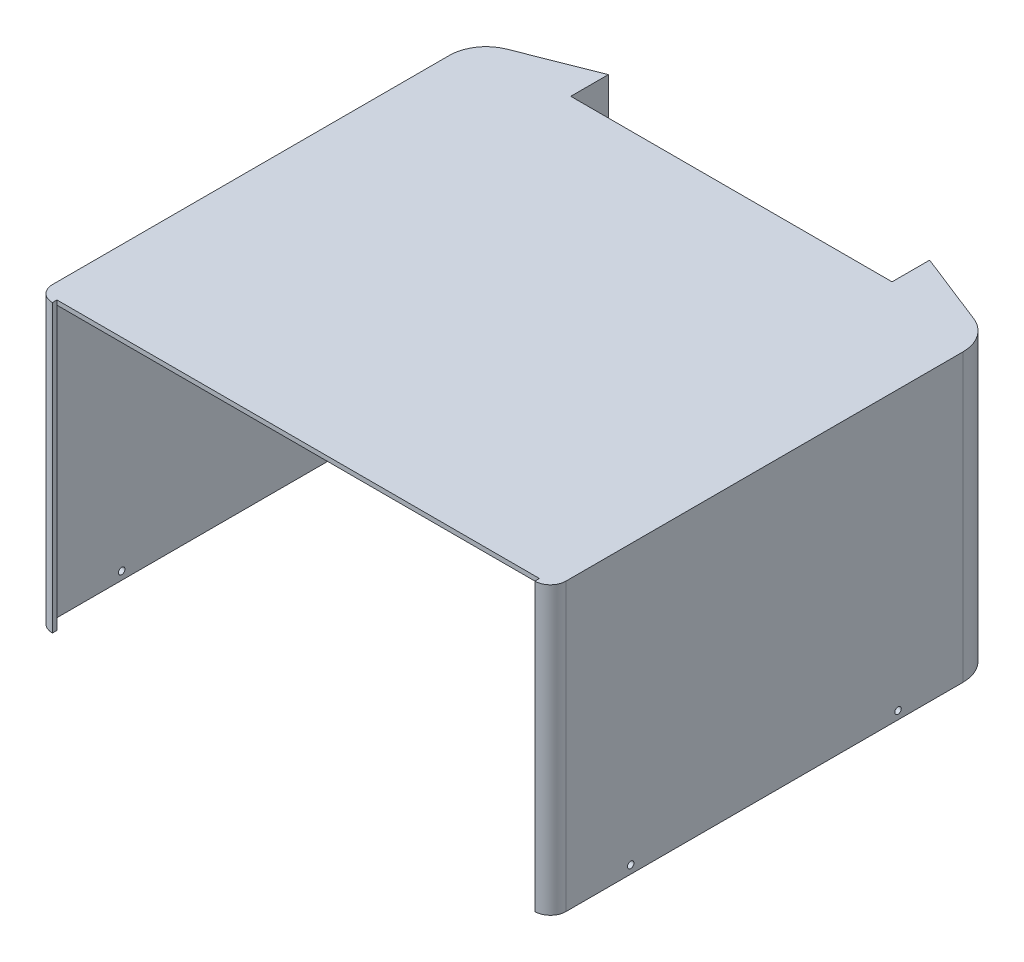
ISO-10303-21;
HEADER;
FILE_DESCRIPTION(('STEP AP214'),'2;1');
FILE_NAME('part.step','',(''),(''),'','','');
FILE_SCHEMA(('AUTOMOTIVE_DESIGN { 1 0 10303 214 1 1 1 1 }'));
ENDSEC;
DATA;
#1=APPLICATION_CONTEXT('core data for automotive mechanical design processes');
#2=APPLICATION_PROTOCOL_DEFINITION('international standard','automotive_design',2000,#1);
#3=PRODUCT_CONTEXT('',#1,'mechanical');
#4=PRODUCT('Part','Part','',(#3));
#5=PRODUCT_RELATED_PRODUCT_CATEGORY('part','',(#4));
#6=PRODUCT_DEFINITION_FORMATION('','',#4);
#7=PRODUCT_DEFINITION_CONTEXT('part definition',#1,'design');
#8=PRODUCT_DEFINITION('design','',#6,#7);
#9=PRODUCT_DEFINITION_SHAPE('','',#8);
#10=(LENGTH_UNIT() NAMED_UNIT(*) SI_UNIT(.MILLI.,.METRE.));
#11=(NAMED_UNIT(*) PLANE_ANGLE_UNIT() SI_UNIT($,.RADIAN.));
#12=(NAMED_UNIT(*) SI_UNIT($,.STERADIAN.) SOLID_ANGLE_UNIT());
#13=UNCERTAINTY_MEASURE_WITH_UNIT(LENGTH_MEASURE(1.E-05),#10,'distance_accuracy_value','');
#14=(GEOMETRIC_REPRESENTATION_CONTEXT(3) GLOBAL_UNCERTAINTY_ASSIGNED_CONTEXT((#13)) GLOBAL_UNIT_ASSIGNED_CONTEXT((#10,
#11,#12)) REPRESENTATION_CONTEXT('',''));
#15=CARTESIAN_POINT('',(0.,0.,0.));
#16=DIRECTION('',(0.,0.,1.));
#17=DIRECTION('',(1.,0.,0.));
#18=AXIS2_PLACEMENT_3D('',#15,#16,#17);
#19=CARTESIAN_POINT('',(-50.0594055574218,82.,0.));
#20=DIRECTION('',(-1.,0.,0.));
#21=DIRECTION('',(0.,0.,1.));
#22=AXIS2_PLACEMENT_3D('',#19,#20,#21);
#23=PLANE('',#22);
#24=DIRECTION('',(0.,0.,1.));
#25=VECTOR('',#24,1.);
#26=CARTESIAN_POINT('',(-50.0594055574218,81.6600000000001,-61.0605386585292));
#27=LINE('',#26,#25);
#28=CARTESIAN_POINT('',(-50.0594055574218,81.6600000000001,-61.0605386585292));
#29=VERTEX_POINT('',#28);
#30=CARTESIAN_POINT('',(-50.0594055574218,81.6600000000001,-59.6605386585292));
#31=VERTEX_POINT('',#30);
#32=EDGE_CURVE('E420',#29,#31,#27,.T.);
#33=ORIENTED_EDGE('',*,*,#32,.T.);
#34=DIRECTION('',(0.,-1.,0.));
#35=VECTOR('',#34,1.);
#36=CARTESIAN_POINT('',(-50.0594055574218,96.9,-59.6605386585272));
#37=LINE('',#36,#35);
#38=CARTESIAN_POINT('',(-50.0594055574218,0.,-59.6605386585272));
#39=VERTEX_POINT('',#38);
#40=EDGE_CURVE('E49',#31,#39,#37,.T.);
#41=ORIENTED_EDGE('',*,*,#40,.T.);
#42=DIRECTION('',(0.,0.,-1.));
#43=VECTOR('',#42,1.);
#44=CARTESIAN_POINT('',(-50.0594055574218,0.,0.));
#45=LINE('',#44,#43);
#46=CARTESIAN_POINT('',(-50.0594055574218,0.,-72.6605386585272));
#47=VERTEX_POINT('',#46);
#48=EDGE_CURVE('E336',#39,#47,#45,.T.);
#49=ORIENTED_EDGE('',*,*,#48,.T.);
#50=DIRECTION('',(0.,-1.,0.));
#51=VECTOR('',#50,1.);
#52=CARTESIAN_POINT('',(-50.0594055574218,82.,-72.6605386585272));
#53=LINE('',#52,#51);
#54=CARTESIAN_POINT('',(-50.0594055574218,88.4,-72.6605386585272));
#55=VERTEX_POINT('',#54);
#56=EDGE_CURVE('E247',#55,#47,#53,.T.);
#57=ORIENTED_EDGE('',*,*,#56,.F.);
#58=DIRECTION('',(0.,0.,-1.));
#59=VECTOR('',#58,1.);
#60=CARTESIAN_POINT('',(-50.0594055574218,88.4,0.));
#61=LINE('',#60,#59);
#62=CARTESIAN_POINT('',(-50.0594055574218,88.4,-61.0605386585292));
#63=VERTEX_POINT('',#62);
#64=EDGE_CURVE('E229',#63,#55,#61,.T.);
#65=ORIENTED_EDGE('',*,*,#64,.F.);
#66=DIRECTION('',(0.,-1.,0.));
#67=VECTOR('',#66,1.);
#68=CARTESIAN_POINT('',(-50.0594055574218,0.,-61.0605386585292));
#69=LINE('',#68,#67);
#70=EDGE_CURVE('E236',#63,#29,#69,.T.);
#71=ORIENTED_EDGE('',*,*,#70,.T.);
#72=EDGE_LOOP('',(#33,#41,#49,#57,#65,#71));
#73=FACE_BOUND('',#72,.T.);
#74=ADVANCED_FACE('F45',(#73),#23,.F.);
#75=CARTESIAN_POINT('',(49.1720519476544,88.4,0.));
#76=DIRECTION('',(1.,0.,0.));
#77=DIRECTION('',(0.,0.,-1.));
#78=AXIS2_PLACEMENT_3D('',#75,#76,#77);
#79=PLANE('',#78);
#80=DIRECTION('',(0.,0.,1.));
#81=VECTOR('',#80,1.);
#82=CARTESIAN_POINT('',(49.1720519476541,81.66,-61.0605386585272));
#83=LINE('',#82,#81);
#84=CARTESIAN_POINT('',(49.1720519476541,81.66,-61.0605386585272));
#85=VERTEX_POINT('',#84);
#86=CARTESIAN_POINT('',(49.1720519476544,81.66,-59.6605386585272));
#87=VERTEX_POINT('',#86);
#88=EDGE_CURVE('E447',#85,#87,#83,.T.);
#89=ORIENTED_EDGE('',*,*,#88,.F.);
#90=DIRECTION('',(0.,-1.,0.));
#91=VECTOR('',#90,1.);
#92=CARTESIAN_POINT('',(49.1720519476509,-1.92367756039792E-12,-61.0605386585272));
#93=LINE('',#92,#91);
#94=CARTESIAN_POINT('',(49.1720519476544,88.4,-61.0605386585272));
#95=VERTEX_POINT('',#94);
#96=EDGE_CURVE('E235',#95,#85,#93,.T.);
#97=ORIENTED_EDGE('',*,*,#96,.F.);
#98=DIRECTION('',(0.,0.,1.));
#99=VECTOR('',#98,1.);
#100=CARTESIAN_POINT('',(49.1720519476544,88.4,0.));
#101=LINE('',#100,#99);
#102=CARTESIAN_POINT('',(49.1720519476544,88.4,-72.6605386585272));
#103=VERTEX_POINT('',#102);
#104=EDGE_CURVE('E232',#103,#95,#101,.T.);
#105=ORIENTED_EDGE('',*,*,#104,.F.);
#106=DIRECTION('',(0.,-1.,0.));
#107=VECTOR('',#106,1.);
#108=CARTESIAN_POINT('',(49.1720519476544,88.4,-72.6605386585272));
#109=LINE('',#108,#107);
#110=CARTESIAN_POINT('',(49.1720519476544,0.,-72.6605386585272));
#111=VERTEX_POINT('',#110);
#112=EDGE_CURVE('E284',#103,#111,#109,.T.);
#113=ORIENTED_EDGE('',*,*,#112,.T.);
#114=DIRECTION('',(0.,0.,-1.));
#115=VECTOR('',#114,1.);
#116=CARTESIAN_POINT('',(49.1720519476544,0.,0.));
#117=LINE('',#116,#115);
#118=CARTESIAN_POINT('',(49.1720519476544,0.,-59.6605386585272));
#119=VERTEX_POINT('',#118);
#120=EDGE_CURVE('E522',#119,#111,#117,.T.);
#121=ORIENTED_EDGE('',*,*,#120,.F.);
#122=DIRECTION('',(0.,-1.,0.));
#123=VECTOR('',#122,1.);
#124=CARTESIAN_POINT('',(49.1720519476544,82.,-59.6605386585272));
#125=LINE('',#124,#123);
#126=EDGE_CURVE('E544',#87,#119,#125,.T.);
#127=ORIENTED_EDGE('',*,*,#126,.F.);
#128=EDGE_LOOP('',(#89,#97,#105,#113,#121,#127));
#129=FACE_BOUND('',#128,.T.);
#130=ADVANCED_FACE('F487',(#129),#79,.F.);
#131=CARTESIAN_POINT('',(0.,87.,0.));
#132=DIRECTION('',(0.,1.,0.));
#133=DIRECTION('',(0.,0.,1.));
#134=AXIS2_PLACEMENT_3D('',#131,#132,#133);
#135=PLANE('',#134);
#136=DIRECTION('',(1.,0.,0.));
#137=VECTOR('',#136,1.);
#138=CARTESIAN_POINT('',(-51.4594055574218,87.,-59.6605386585272));
#139=LINE('',#138,#137);
#140=CARTESIAN_POINT('',(-51.4594055574218,87.,-59.6605386585272));
#141=VERTEX_POINT('',#140);
#142=CARTESIAN_POINT('',(50.5720519476544,87.,-59.6605386585272));
#143=VERTEX_POINT('',#142);
#144=EDGE_CURVE('E304',#141,#143,#139,.T.);
#145=ORIENTED_EDGE('',*,*,#144,.T.);
#146=DIRECTION('',(0.,0.,-1.));
#147=VECTOR('',#146,1.);
#148=CARTESIAN_POINT('',(50.5720519476544,87.,-59.6605386585272));
#149=LINE('',#148,#147);
#150=CARTESIAN_POINT('',(50.5720519476544,87.,-70.6049959841991));
#151=VERTEX_POINT('',#150);
#152=EDGE_CURVE('E446',#143,#151,#149,.T.);
#153=ORIENTED_EDGE('',*,*,#152,.T.);
#154=DIRECTION('',(0.930522484488547,0.,0.366234768777162));
#155=VECTOR('',#154,1.);
#156=CARTESIAN_POINT('',(50.5720519476544,87.,-70.6049959841991));
#157=LINE('',#156,#155);
#158=CARTESIAN_POINT('',(71.1186708828879,87.,-62.5182636802143));
#159=VERTEX_POINT('',#158);
#160=EDGE_CURVE('E497',#151,#159,#157,.T.);
#161=ORIENTED_EDGE('',*,*,#160,.T.);
#162=CARTESIAN_POINT('',(67.4563231951163,87.,-53.2130388353289));
#163=DIRECTION('',(0.,-1.,0.));
#164=DIRECTION('',(0.,0.,1.));
#165=AXIS2_PLACEMENT_3D('',#162,#163,#164);
#166=CIRCLE('',#165,9.99999999999996);
#167=CARTESIAN_POINT('',(77.4563231951162,87.,-53.2130388353289));
#168=VERTEX_POINT('',#167);
#169=EDGE_CURVE('E500',#159,#168,#166,.T.);
#170=ORIENTED_EDGE('',*,*,#169,.T.);
#171=DIRECTION('',(0.,0.,1.));
#172=VECTOR('',#171,1.);
#173=CARTESIAN_POINT('',(77.4563231951162,87.,-53.2130388353289));
#174=LINE('',#173,#172);
#175=CARTESIAN_POINT('',(77.4563231951163,87.,69.3394613414728));
#176=VERTEX_POINT('',#175);
#177=EDGE_CURVE('E444',#168,#176,#174,.T.);
#178=ORIENTED_EDGE('',*,*,#177,.T.);
#179=CARTESIAN_POINT('',(74.0563231951163,87.,69.3394613414728));
#180=DIRECTION('',(0.,-1.,0.));
#181=DIRECTION('',(0.,0.,1.));
#182=AXIS2_PLACEMENT_3D('',#179,#180,#181);
#183=CIRCLE('',#182,3.39999999999999);
#184=CARTESIAN_POINT('',(74.0563231951163,87.,72.7394613414728));
#185=VERTEX_POINT('',#184);
#186=EDGE_CURVE('E441',#176,#185,#183,.T.);
#187=ORIENTED_EDGE('',*,*,#186,.T.);
#188=DIRECTION('',(-1.,0.,0.));
#189=VECTOR('',#188,1.);
#190=CARTESIAN_POINT('',(0.,87.,72.7394613414728));
#191=LINE('',#190,#189);
#192=CARTESIAN_POINT('',(-74.9436768048837,87.,72.7394613414728));
#193=VERTEX_POINT('',#192);
#194=EDGE_CURVE('E250',#185,#193,#191,.T.);
#195=ORIENTED_EDGE('',*,*,#194,.T.);
#196=CARTESIAN_POINT('',(-74.9436768048837,87.,69.3394613414728));
#197=DIRECTION('',(0.,-1.,0.));
#198=DIRECTION('',(0.,0.,1.));
#199=AXIS2_PLACEMENT_3D('',#196,#197,#198);
#200=CIRCLE('',#199,3.4);
#201=CARTESIAN_POINT('',(-78.3436768048837,87.,69.3394613414728));
#202=VERTEX_POINT('',#201);
#203=EDGE_CURVE('E306',#193,#202,#200,.T.);
#204=ORIENTED_EDGE('',*,*,#203,.T.);
#205=DIRECTION('',(0.,0.,-1.));
#206=VECTOR('',#205,1.);
#207=CARTESIAN_POINT('',(-78.3436768048837,87.,69.3394613414728));
#208=LINE('',#207,#206);
#209=CARTESIAN_POINT('',(-78.3436768048837,87.,-53.2130388353288));
#210=VERTEX_POINT('',#209);
#211=EDGE_CURVE('E309',#202,#210,#208,.T.);
#212=ORIENTED_EDGE('',*,*,#211,.T.);
#213=CARTESIAN_POINT('',(-68.3436768048837,87.,-53.2130388353289));
#214=DIRECTION('',(0.,-1.,0.));
#215=DIRECTION('',(0.,0.,1.));
#216=AXIS2_PLACEMENT_3D('',#213,#214,#215);
#217=CIRCLE('',#216,10.);
#218=CARTESIAN_POINT('',(-72.0060244926553,87.,-62.5182636802143));
#219=VERTEX_POINT('',#218);
#220=EDGE_CURVE('E312',#210,#219,#217,.T.);
#221=ORIENTED_EDGE('',*,*,#220,.T.);
#222=DIRECTION('',(0.930522484488548,0.,-0.36623476877716));
#223=VECTOR('',#222,1.);
#224=CARTESIAN_POINT('',(-72.0060244926553,87.,-62.5182636802143));
#225=LINE('',#224,#223);
#226=CARTESIAN_POINT('',(-51.4594055574218,87.,-70.6049959841991));
#227=VERTEX_POINT('',#226);
#228=EDGE_CURVE('E315',#219,#227,#225,.T.);
#229=ORIENTED_EDGE('',*,*,#228,.T.);
#230=DIRECTION('',(0.,0.,1.));
#231=VECTOR('',#230,1.);
#232=CARTESIAN_POINT('',(-51.4594055574218,87.,-70.6049959841991));
#233=LINE('',#232,#231);
#234=EDGE_CURVE('E301',#227,#141,#233,.T.);
#235=ORIENTED_EDGE('',*,*,#234,.T.);
#236=EDGE_LOOP('',(#145,#153,#161,#170,#178,#187,#195,#204,#212,#221,#229,#235));
#237=FACE_BOUND('',#236,.T.);
#238=ADVANCED_FACE('F437',(#237),#135,.F.);
#239=CARTESIAN_POINT('',(0.,0.,0.));
#240=DIRECTION('',(0.,1.,0.));
#241=DIRECTION('',(0.,0.,1.));
#242=AXIS2_PLACEMENT_3D('',#239,#240,#241);
#243=PLANE('',#242);
#244=CARTESIAN_POINT('',(-74.9436768048837,0.,69.3394613414728));
#245=DIRECTION('',(0.,1.,0.));
#246=DIRECTION('',(0.,0.,1.));
#247=AXIS2_PLACEMENT_3D('',#244,#245,#246);
#248=CIRCLE('',#247,3.4);
#249=CARTESIAN_POINT('',(-78.3436768048837,0.,69.3394613414728));
#250=VERTEX_POINT('',#249);
#251=CARTESIAN_POINT('',(-74.9436768048837,0.,72.7394613414728));
#252=VERTEX_POINT('',#251);
#253=EDGE_CURVE('E318',#250,#252,#248,.T.);
#254=ORIENTED_EDGE('',*,*,#253,.T.);
#255=DIRECTION('',(0.,0.,1.));
#256=VECTOR('',#255,1.);
#257=CARTESIAN_POINT('',(-74.9436768048837,0.,72.6394613414728));
#258=LINE('',#257,#256);
#259=CARTESIAN_POINT('',(-74.9436768048837,0.,74.1394613414728));
#260=VERTEX_POINT('',#259);
#261=EDGE_CURVE('E70',#252,#260,#258,.T.);
#262=ORIENTED_EDGE('',*,*,#261,.T.);
#263=CARTESIAN_POINT('',(-74.9436768048837,0.,69.3394613414728));
#264=DIRECTION('',(0.,1.,0.));
#265=DIRECTION('',(0.,0.,1.));
#266=AXIS2_PLACEMENT_3D('',#263,#264,#265);
#267=CIRCLE('',#266,4.8);
#268=CARTESIAN_POINT('',(-79.7436768048837,0.,69.3394613414728));
#269=VERTEX_POINT('',#268);
#270=EDGE_CURVE('E341',#269,#260,#267,.T.);
#271=ORIENTED_EDGE('',*,*,#270,.F.);
#272=DIRECTION('',(0.,0.,1.));
#273=VECTOR('',#272,1.);
#274=CARTESIAN_POINT('',(-79.7436768048837,0.,0.));
#275=LINE('',#274,#273);
#276=CARTESIAN_POINT('',(-79.7436768048837,0.,-53.2130388353288));
#277=VERTEX_POINT('',#276);
#278=EDGE_CURVE('E338',#277,#269,#275,.T.);
#279=ORIENTED_EDGE('',*,*,#278,.F.);
#280=CARTESIAN_POINT('',(-68.3436768048837,0.,-53.2130388353289));
#281=DIRECTION('',(0.,1.,0.));
#282=DIRECTION('',(0.,0.,1.));
#283=AXIS2_PLACEMENT_3D('',#280,#281,#282);
#284=CIRCLE('',#283,11.4);
#285=CARTESIAN_POINT('',(-72.5187531689433,0.,-63.8209951584983));
#286=VERTEX_POINT('',#285);
#287=EDGE_CURVE('E351',#277,#286,#284,.F.);
#288=ORIENTED_EDGE('',*,*,#287,.T.);
#289=DIRECTION('',(0.930522484488547,0.,-0.366234768777162));
#290=VECTOR('',#289,1.);
#291=CARTESIAN_POINT('',(-31.4763254590337,0.,-79.9744619182552));
#292=LINE('',#291,#290);
#293=EDGE_CURVE('E354',#286,#47,#292,.T.);
#294=ORIENTED_EDGE('',*,*,#293,.T.);
#295=ORIENTED_EDGE('',*,*,#48,.F.);
#296=DIRECTION('',(-1.,0.,0.));
#297=VECTOR('',#296,1.);
#298=CARTESIAN_POINT('',(0.,0.,-59.6605386585272));
#299=LINE('',#298,#297);
#300=CARTESIAN_POINT('',(-51.4594055574218,0.,-59.6605386585272));
#301=VERTEX_POINT('',#300);
#302=EDGE_CURVE('E357',#39,#301,#299,.T.);
#303=ORIENTED_EDGE('',*,*,#302,.T.);
#304=DIRECTION('',(0.,0.,-1.));
#305=VECTOR('',#304,1.);
#306=CARTESIAN_POINT('',(-51.4594055574218,0.,0.));
#307=LINE('',#306,#305);
#308=CARTESIAN_POINT('',(-51.4594055574218,0.,-70.6049959841991));
#309=VERTEX_POINT('',#308);
#310=EDGE_CURVE('E361',#301,#309,#307,.T.);
#311=ORIENTED_EDGE('',*,*,#310,.T.);
#312=DIRECTION('',(0.930522484488547,0.,-0.366234768777162));
#313=VECTOR('',#312,1.);
#314=CARTESIAN_POINT('',(-30.9635967827457,0.,-78.6717304399712));
#315=LINE('',#314,#313);
#316=CARTESIAN_POINT('',(-72.0060244926553,0.,-62.5182636802143));
#317=VERTEX_POINT('',#316);
#318=EDGE_CURVE('E329',#317,#309,#315,.T.);
#319=ORIENTED_EDGE('',*,*,#318,.F.);
#320=CARTESIAN_POINT('',(-68.3436768048837,0.,-53.2130388353289));
#321=DIRECTION('',(0.,1.,0.));
#322=DIRECTION('',(0.,0.,1.));
#323=AXIS2_PLACEMENT_3D('',#320,#321,#322);
#324=CIRCLE('',#323,9.99999999999998);
#325=CARTESIAN_POINT('',(-78.3436768048837,0.,-53.2130388353288));
#326=VERTEX_POINT('',#325);
#327=EDGE_CURVE('E326',#326,#317,#324,.F.);
#328=ORIENTED_EDGE('',*,*,#327,.F.);
#329=DIRECTION('',(0.,0.,1.));
#330=VECTOR('',#329,1.);
#331=CARTESIAN_POINT('',(-78.3436768048837,0.,0.));
#332=LINE('',#331,#330);
#333=EDGE_CURVE('E322',#326,#250,#332,.T.);
#334=ORIENTED_EDGE('',*,*,#333,.T.);
#335=EDGE_LOOP('',(#254,#262,#271,#279,#288,#294,#295,#303,#311,#319,#328,#334));
#336=FACE_BOUND('',#335,.T.);
#337=ADVANCED_FACE('F47',(#336),#243,.F.);
#338=CARTESIAN_POINT('',(-74.9436768048837,82.,69.3394613414728));
#339=DIRECTION('',(0.,-1.,0.));
#340=DIRECTION('',(0.,0.,-1.));
#341=AXIS2_PLACEMENT_3D('',#338,#339,#340);
#342=CYLINDRICAL_SURFACE('',#341,3.4);
#343=DIRECTION('',(0.,-1.,0.));
#344=VECTOR('',#343,1.);
#345=CARTESIAN_POINT('',(-78.3436768048837,82.,69.3394613414728));
#346=LINE('',#345,#344);
#347=EDGE_CURVE('E321',#202,#250,#346,.T.);
#348=ORIENTED_EDGE('',*,*,#347,.F.);
#349=ORIENTED_EDGE('',*,*,#203,.F.);
#350=DIRECTION('',(0.,-1.,0.));
#351=VECTOR('',#350,1.);
#352=CARTESIAN_POINT('',(-74.9436768048837,82.,72.7394613414728));
#353=LINE('',#352,#351);
#354=EDGE_CURVE('E319',#193,#252,#353,.T.);
#355=ORIENTED_EDGE('',*,*,#354,.T.);
#356=ORIENTED_EDGE('',*,*,#253,.F.);
#357=EDGE_LOOP('',(#348,#349,#355,#356));
#358=FACE_BOUND('',#357,.T.);
#359=ADVANCED_FACE('F401',(#358),#342,.F.);
#360=CARTESIAN_POINT('',(-78.3436768048837,82.,0.));
#361=DIRECTION('',(1.,0.,0.));
#362=DIRECTION('',(0.,0.,-1.));
#363=AXIS2_PLACEMENT_3D('',#360,#361,#362);
#364=PLANE('',#363);
#365=CARTESIAN_POINT('',(-78.3436768048837,2.5,-33.2130388353288));
#366=DIRECTION('',(1.,0.,0.));
#367=DIRECTION('',(0.,0.,-1.));
#368=AXIS2_PLACEMENT_3D('',#365,#366,#367);
#369=CIRCLE('',#368,0.999999999999998);
#370=CARTESIAN_POINT('',(-78.3436768048837,2.5,-34.2130388353288));
#371=VERTEX_POINT('',#370);
#372=EDGE_CURVE('E54',#371,#371,#369,.T.);
#373=ORIENTED_EDGE('',*,*,#372,.F.);
#374=EDGE_LOOP('',(#373));
#375=FACE_BOUND('',#374,.T.);
#376=CARTESIAN_POINT('',(-78.3436768048837,2.5,49.3394613414728));
#377=DIRECTION('',(1.,0.,0.));
#378=DIRECTION('',(0.,0.,-1.));
#379=AXIS2_PLACEMENT_3D('',#376,#377,#378);
#380=CIRCLE('',#379,0.999999999999998);
#381=CARTESIAN_POINT('',(-78.3436768048837,2.5,48.3394613414728));
#382=VERTEX_POINT('',#381);
#383=EDGE_CURVE('E347',#382,#382,#380,.T.);
#384=ORIENTED_EDGE('',*,*,#383,.F.);
#385=EDGE_LOOP('',(#384));
#386=FACE_BOUND('',#385,.T.);
#387=DIRECTION('',(0.,-1.,0.));
#388=VECTOR('',#387,1.);
#389=CARTESIAN_POINT('',(-78.3436768048837,82.,-53.2130388353288));
#390=LINE('',#389,#388);
#391=EDGE_CURVE('E324',#210,#326,#390,.T.);
#392=ORIENTED_EDGE('',*,*,#391,.F.);
#393=ORIENTED_EDGE('',*,*,#211,.F.);
#394=ORIENTED_EDGE('',*,*,#347,.T.);
#395=ORIENTED_EDGE('',*,*,#333,.F.);
#396=EDGE_LOOP('',(#392,#393,#394,#395));
#397=FACE_BOUND('',#396,.T.);
#398=ADVANCED_FACE('F435',(#375,#386,#397),#364,.T.);
#399=CARTESIAN_POINT('',(-68.3436768048837,82.,-53.2130388353289));
#400=DIRECTION('',(0.,-1.,0.));
#401=DIRECTION('',(0.,0.,-1.));
#402=AXIS2_PLACEMENT_3D('',#399,#400,#401);
#403=CYLINDRICAL_SURFACE('',#402,9.99999999999998);
#404=DIRECTION('',(0.,-1.,0.));
#405=VECTOR('',#404,1.);
#406=CARTESIAN_POINT('',(-72.0060244926553,82.,-62.5182636802143));
#407=LINE('',#406,#405);
#408=EDGE_CURVE('E327',#219,#317,#407,.T.);
#409=ORIENTED_EDGE('',*,*,#408,.F.);
#410=ORIENTED_EDGE('',*,*,#220,.F.);
#411=ORIENTED_EDGE('',*,*,#391,.T.);
#412=ORIENTED_EDGE('',*,*,#327,.T.);
#413=EDGE_LOOP('',(#409,#410,#411,#412));
#414=FACE_BOUND('',#413,.T.);
#415=ADVANCED_FACE('F433',(#414),#403,.F.);
#416=CARTESIAN_POINT('',(-30.9635967827457,82.,-78.6717304399712));
#417=DIRECTION('',(-0.366234768777162,0.,-0.930522484488547));
#418=DIRECTION('',(-0.930522484488547,0.,0.366234768777162));
#419=AXIS2_PLACEMENT_3D('',#416,#417,#418);
#420=PLANE('',#419);
#421=DIRECTION('',(0.,-1.,0.));
#422=VECTOR('',#421,1.);
#423=CARTESIAN_POINT('',(-51.4594055574218,82.,-70.6049959841991));
#424=LINE('',#423,#422);
#425=EDGE_CURVE('E330',#227,#309,#424,.T.);
#426=ORIENTED_EDGE('',*,*,#425,.F.);
#427=ORIENTED_EDGE('',*,*,#228,.F.);
#428=ORIENTED_EDGE('',*,*,#408,.T.);
#429=ORIENTED_EDGE('',*,*,#318,.T.);
#430=EDGE_LOOP('',(#426,#427,#428,#429));
#431=FACE_BOUND('',#430,.T.);
#432=ADVANCED_FACE('F430',(#431),#420,.F.);
#433=CARTESIAN_POINT('',(-51.4594055574218,82.,0.));
#434=DIRECTION('',(-1.,0.,0.));
#435=DIRECTION('',(0.,0.,1.));
#436=AXIS2_PLACEMENT_3D('',#433,#434,#435);
#437=PLANE('',#436);
#438=DIRECTION('',(0.,-1.,0.));
#439=VECTOR('',#438,1.);
#440=CARTESIAN_POINT('',(-51.4594055574218,82.,-59.6605386585272));
#441=LINE('',#440,#439);
#442=EDGE_CURVE('E332',#141,#301,#441,.T.);
#443=ORIENTED_EDGE('',*,*,#442,.F.);
#444=ORIENTED_EDGE('',*,*,#234,.F.);
#445=ORIENTED_EDGE('',*,*,#425,.T.);
#446=ORIENTED_EDGE('',*,*,#310,.F.);
#447=EDGE_LOOP('',(#443,#444,#445,#446));
#448=FACE_BOUND('',#447,.T.);
#449=ADVANCED_FACE('F426',(#448),#437,.T.);
#450=CARTESIAN_POINT('',(0.,82.,-59.6605386585272));
#451=DIRECTION('',(0.,0.,1.));
#452=DIRECTION('',(1.,0.,0.));
#453=AXIS2_PLACEMENT_3D('',#450,#451,#452);
#454=PLANE('',#453);
#455=ORIENTED_EDGE('',*,*,#302,.F.);
#456=ORIENTED_EDGE('',*,*,#40,.F.);
#457=DIRECTION('',(-1.,0.,0.));
#458=VECTOR('',#457,1.);
#459=CARTESIAN_POINT('',(1.21471754603014E-12,81.66,-59.6605386585282));
#460=LINE('',#459,#458);
#461=EDGE_CURVE('E61',#87,#31,#460,.T.);
#462=ORIENTED_EDGE('',*,*,#461,.F.);
#463=ORIENTED_EDGE('',*,*,#126,.T.);
#464=DIRECTION('',(1.,0.,0.));
#465=VECTOR('',#464,1.);
#466=CARTESIAN_POINT('',(0.,0.,-59.6605386585272));
#467=LINE('',#466,#465);
#468=CARTESIAN_POINT('',(50.5720519476544,0.,-59.6605386585272));
#469=VERTEX_POINT('',#468);
#470=EDGE_CURVE('E524',#119,#469,#467,.T.);
#471=ORIENTED_EDGE('',*,*,#470,.T.);
#472=DIRECTION('',(0.,-1.,0.));
#473=VECTOR('',#472,1.);
#474=CARTESIAN_POINT('',(50.5720519476544,82.,-59.6605386585272));
#475=LINE('',#474,#473);
#476=EDGE_CURVE('E542',#143,#469,#475,.T.);
#477=ORIENTED_EDGE('',*,*,#476,.F.);
#478=ORIENTED_EDGE('',*,*,#144,.F.);
#479=ORIENTED_EDGE('',*,*,#442,.T.);
#480=EDGE_LOOP('',(#455,#456,#462,#463,#471,#477,#478,#479));
#481=FACE_BOUND('',#480,.T.);
#482=ADVANCED_FACE('F421',(#481),#454,.T.);
#483=CARTESIAN_POINT('',(-31.4763254590337,82.,-79.9744619182552));
#484=DIRECTION('',(-0.366234768777162,0.,-0.930522484488547));
#485=DIRECTION('',(-0.930522484488547,0.,0.366234768777162));
#486=AXIS2_PLACEMENT_3D('',#483,#484,#485);
#487=PLANE('',#486);
#488=ORIENTED_EDGE('',*,*,#293,.F.);
#489=DIRECTION('',(0.,-1.,0.));
#490=VECTOR('',#489,1.);
#491=CARTESIAN_POINT('',(-72.5187531689433,82.,-63.8209951584983));
#492=LINE('',#491,#490);
#493=CARTESIAN_POINT('',(-72.5187531689434,88.4,-63.8209951584983));
#494=VERTEX_POINT('',#493);
#495=EDGE_CURVE('E335',#494,#286,#492,.T.);
#496=ORIENTED_EDGE('',*,*,#495,.F.);
#497=DIRECTION('',(-0.930522484488547,0.,0.366234768777162));
#498=VECTOR('',#497,1.);
#499=CARTESIAN_POINT('',(-31.4763254590337,88.4,-79.9744619182552));
#500=LINE('',#499,#498);
#501=EDGE_CURVE('E249',#55,#494,#500,.T.);
#502=ORIENTED_EDGE('',*,*,#501,.F.);
#503=ORIENTED_EDGE('',*,*,#56,.T.);
#504=EDGE_LOOP('',(#488,#496,#502,#503));
#505=FACE_BOUND('',#504,.T.);
#506=ADVANCED_FACE('F419',(#505),#487,.T.);
#507=CARTESIAN_POINT('',(-68.3436768048837,82.,-53.2130388353289));
#508=DIRECTION('',(0.,-1.,0.));
#509=DIRECTION('',(0.,0.,-1.));
#510=AXIS2_PLACEMENT_3D('',#507,#508,#509);
#511=CYLINDRICAL_SURFACE('',#510,11.4);
#512=ORIENTED_EDGE('',*,*,#287,.F.);
#513=DIRECTION('',(0.,-1.,0.));
#514=VECTOR('',#513,1.);
#515=CARTESIAN_POINT('',(-79.7436768048837,82.,-53.2130388353288));
#516=LINE('',#515,#514);
#517=CARTESIAN_POINT('',(-79.7436768048837,88.4,-53.2130388353288));
#518=VERTEX_POINT('',#517);
#519=EDGE_CURVE('E339',#518,#277,#516,.T.);
#520=ORIENTED_EDGE('',*,*,#519,.F.);
#521=CARTESIAN_POINT('',(-68.3436768048837,88.4,-53.2130388353289));
#522=DIRECTION('',(0.,1.,0.));
#523=DIRECTION('',(0.,0.,1.));
#524=AXIS2_PLACEMENT_3D('',#521,#522,#523);
#525=CIRCLE('',#524,11.4);
#526=EDGE_CURVE('E252',#494,#518,#525,.T.);
#527=ORIENTED_EDGE('',*,*,#526,.F.);
#528=ORIENTED_EDGE('',*,*,#495,.T.);
#529=EDGE_LOOP('',(#512,#520,#527,#528));
#530=FACE_BOUND('',#529,.T.);
#531=ADVANCED_FACE('F387',(#530),#511,.T.);
#532=CARTESIAN_POINT('',(-79.7436768048837,82.,0.));
#533=DIRECTION('',(1.,0.,0.));
#534=DIRECTION('',(0.,0.,-1.));
#535=AXIS2_PLACEMENT_3D('',#532,#533,#534);
#536=PLANE('',#535);
#537=CARTESIAN_POINT('',(-79.7436768048837,2.5,-33.2130388353288));
#538=DIRECTION('',(-1.,0.,0.));
#539=DIRECTION('',(0.,0.,1.));
#540=AXIS2_PLACEMENT_3D('',#537,#538,#539);
#541=CIRCLE('',#540,0.999999999999998);
#542=CARTESIAN_POINT('',(-79.7436768048837,2.5,-32.2130388353288));
#543=VERTEX_POINT('',#542);
#544=EDGE_CURVE('E11',#543,#543,#541,.T.);
#545=ORIENTED_EDGE('',*,*,#544,.F.);
#546=EDGE_LOOP('',(#545));
#547=FACE_BOUND('',#546,.T.);
#548=CARTESIAN_POINT('',(-79.7436768048837,2.5,49.3394613414728));
#549=DIRECTION('',(-1.,0.,0.));
#550=DIRECTION('',(0.,0.,1.));
#551=AXIS2_PLACEMENT_3D('',#548,#549,#550);
#552=CIRCLE('',#551,0.999999999999998);
#553=CARTESIAN_POINT('',(-79.7436768048837,2.5,50.3394613414728));
#554=VERTEX_POINT('',#553);
#555=EDGE_CURVE('E375',#554,#554,#552,.T.);
#556=ORIENTED_EDGE('',*,*,#555,.F.);
#557=EDGE_LOOP('',(#556));
#558=FACE_BOUND('',#557,.T.);
#559=ORIENTED_EDGE('',*,*,#278,.T.);
#560=DIRECTION('',(0.,-1.,0.));
#561=VECTOR('',#560,1.);
#562=CARTESIAN_POINT('',(-79.7436768048837,82.,69.3394613414728));
#563=LINE('',#562,#561);
#564=CARTESIAN_POINT('',(-79.7436768048837,88.4,69.3394613414728));
#565=VERTEX_POINT('',#564);
#566=EDGE_CURVE('E342',#565,#269,#563,.T.);
#567=ORIENTED_EDGE('',*,*,#566,.F.);
#568=DIRECTION('',(0.,0.,1.));
#569=VECTOR('',#568,1.);
#570=CARTESIAN_POINT('',(-79.7436768048837,88.4,0.));
#571=LINE('',#570,#569);
#572=EDGE_CURVE('E263',#518,#565,#571,.T.);
#573=ORIENTED_EDGE('',*,*,#572,.F.);
#574=ORIENTED_EDGE('',*,*,#519,.T.);
#575=EDGE_LOOP('',(#559,#567,#573,#574));
#576=FACE_BOUND('',#575,.T.);
#577=ADVANCED_FACE('F383',(#547,#558,#576),#536,.F.);
#578=CARTESIAN_POINT('',(-74.9436768048837,82.,69.3394613414728));
#579=DIRECTION('',(0.,-1.,0.));
#580=DIRECTION('',(0.,0.,-1.));
#581=AXIS2_PLACEMENT_3D('',#578,#579,#580);
#582=CYLINDRICAL_SURFACE('',#581,4.8);
#583=ORIENTED_EDGE('',*,*,#270,.T.);
#584=DIRECTION('',(0.,-1.,0.));
#585=VECTOR('',#584,1.);
#586=CARTESIAN_POINT('',(-74.9436768048837,82.,74.1394613414728));
#587=LINE('',#586,#585);
#588=CARTESIAN_POINT('',(-74.9436768048837,88.4,74.1394613414728));
#589=VERTEX_POINT('',#588);
#590=EDGE_CURVE('E345',#589,#260,#587,.T.);
#591=ORIENTED_EDGE('',*,*,#590,.F.);
#592=CARTESIAN_POINT('',(-74.9436768048837,88.4,69.3394613414728));
#593=DIRECTION('',(0.,1.,0.));
#594=DIRECTION('',(0.,0.,1.));
#595=AXIS2_PLACEMENT_3D('',#592,#593,#594);
#596=CIRCLE('',#595,4.80000000000001);
#597=EDGE_CURVE('E266',#565,#589,#596,.T.);
#598=ORIENTED_EDGE('',*,*,#597,.F.);
#599=ORIENTED_EDGE('',*,*,#566,.T.);
#600=EDGE_LOOP('',(#583,#591,#598,#599));
#601=FACE_BOUND('',#600,.T.);
#602=ADVANCED_FACE('F386',(#601),#582,.T.);
#603=CARTESIAN_POINT('',(-74.9436768048837,82.,72.6394613414728));
#604=DIRECTION('',(-1.,0.,0.));
#605=DIRECTION('',(0.,0.,1.));
#606=AXIS2_PLACEMENT_3D('',#603,#604,#605);
#607=PLANE('',#606);
#608=ORIENTED_EDGE('',*,*,#354,.F.);
#609=DIRECTION('',(0.,-1.,0.));
#610=VECTOR('',#609,1.);
#611=CARTESIAN_POINT('',(-74.9436768048837,88.4,72.7394613414728));
#612=LINE('',#611,#610);
#613=CARTESIAN_POINT('',(-74.9436768048837,88.4,72.7394613414728));
#614=VERTEX_POINT('',#613);
#615=EDGE_CURVE('E298',#614,#193,#612,.T.);
#616=ORIENTED_EDGE('',*,*,#615,.F.);
#617=DIRECTION('',(0.,0.,-1.));
#618=VECTOR('',#617,1.);
#619=CARTESIAN_POINT('',(-74.9436768048837,88.4,0.));
#620=LINE('',#619,#618);
#621=EDGE_CURVE('E269',#589,#614,#620,.T.);
#622=ORIENTED_EDGE('',*,*,#621,.F.);
#623=ORIENTED_EDGE('',*,*,#590,.T.);
#624=ORIENTED_EDGE('',*,*,#261,.F.);
#625=EDGE_LOOP('',(#608,#616,#622,#623,#624));
#626=FACE_BOUND('',#625,.T.);
#627=ADVANCED_FACE('F405',(#626),#607,.F.);
#628=CARTESIAN_POINT('',(163.256323195116,2.5,49.3394613414728));
#629=DIRECTION('',(-1.,0.,0.));
#630=DIRECTION('',(0.,0.,1.));
#631=AXIS2_PLACEMENT_3D('',#628,#629,#630);
#632=CYLINDRICAL_SURFACE('',#631,0.999999999999998);
#633=ORIENTED_EDGE('',*,*,#383,.T.);
#634=EDGE_LOOP('',(#633));
#635=FACE_BOUND('',#634,.T.);
#636=ORIENTED_EDGE('',*,*,#555,.T.);
#637=EDGE_LOOP('',(#636));
#638=FACE_BOUND('',#637,.T.);
#639=ADVANCED_FACE('F381',(#635,#638),#632,.F.);
#640=CARTESIAN_POINT('',(163.256323195116,2.5,-33.2130388353288));
#641=DIRECTION('',(-1.,0.,0.));
#642=DIRECTION('',(0.,0.,1.));
#643=AXIS2_PLACEMENT_3D('',#640,#641,#642);
#644=CYLINDRICAL_SURFACE('',#643,0.999999999999998);
#645=ORIENTED_EDGE('',*,*,#372,.T.);
#646=EDGE_LOOP('',(#645));
#647=FACE_BOUND('',#646,.T.);
#648=ORIENTED_EDGE('',*,*,#544,.T.);
#649=EDGE_LOOP('',(#648));
#650=FACE_BOUND('',#649,.T.);
#651=ADVANCED_FACE('F579',(#647,#650),#644,.F.);
#652=CARTESIAN_POINT('',(0.,88.4,72.7394613414728));
#653=DIRECTION('',(0.,0.,1.));
#654=DIRECTION('',(1.,0.,0.));
#655=AXIS2_PLACEMENT_3D('',#652,#653,#654);
#656=PLANE('',#655);
#657=ORIENTED_EDGE('',*,*,#194,.F.);
#658=DIRECTION('',(0.,-1.,0.));
#659=VECTOR('',#658,1.);
#660=CARTESIAN_POINT('',(74.0563231951163,88.4,72.7394613414728));
#661=LINE('',#660,#659);
#662=CARTESIAN_POINT('',(74.0563231951163,88.4,72.7394613414728));
#663=VERTEX_POINT('',#662);
#664=EDGE_CURVE('E295',#663,#185,#661,.T.);
#665=ORIENTED_EDGE('',*,*,#664,.F.);
#666=DIRECTION('',(-1.,0.,0.));
#667=VECTOR('',#666,1.);
#668=CARTESIAN_POINT('',(0.,88.4,72.7394613414728));
#669=LINE('',#668,#667);
#670=EDGE_CURVE('E271',#663,#614,#669,.T.);
#671=ORIENTED_EDGE('',*,*,#670,.T.);
#672=ORIENTED_EDGE('',*,*,#615,.T.);
#673=EDGE_LOOP('',(#657,#665,#671,#672));
#674=FACE_BOUND('',#673,.T.);
#675=ADVANCED_FACE('F410',(#674),#656,.T.);
#676=CARTESIAN_POINT('',(74.0563231951163,88.4,0.));
#677=DIRECTION('',(1.,0.,0.));
#678=DIRECTION('',(0.,0.,-1.));
#679=AXIS2_PLACEMENT_3D('',#676,#677,#678);
#680=PLANE('',#679);
#681=ORIENTED_EDGE('',*,*,#664,.T.);
#682=DIRECTION('',(0.,-1.,0.));
#683=VECTOR('',#682,1.);
#684=CARTESIAN_POINT('',(74.0563231951163,82.,72.7394613414728));
#685=LINE('',#684,#683);
#686=CARTESIAN_POINT('',(74.0563231951163,0.,72.7394613414728));
#687=VERTEX_POINT('',#686);
#688=EDGE_CURVE('E452',#185,#687,#685,.T.);
#689=ORIENTED_EDGE('',*,*,#688,.T.);
#690=DIRECTION('',(0.,0.,1.));
#691=VECTOR('',#690,1.);
#692=CARTESIAN_POINT('',(74.0563231951163,0.,72.6394613414728));
#693=LINE('',#692,#691);
#694=CARTESIAN_POINT('',(74.0563231951163,0.,74.1394613414728));
#695=VERTEX_POINT('',#694);
#696=EDGE_CURVE('E455',#687,#695,#693,.T.);
#697=ORIENTED_EDGE('',*,*,#696,.T.);
#698=DIRECTION('',(0.,-1.,0.));
#699=VECTOR('',#698,1.);
#700=CARTESIAN_POINT('',(74.0563231951163,88.4,74.1394613414728));
#701=LINE('',#700,#699);
#702=CARTESIAN_POINT('',(74.0563231951163,88.4,74.1394613414728));
#703=VERTEX_POINT('',#702);
#704=EDGE_CURVE('E293',#703,#695,#701,.T.);
#705=ORIENTED_EDGE('',*,*,#704,.F.);
#706=DIRECTION('',(0.,0.,1.));
#707=VECTOR('',#706,1.);
#708=CARTESIAN_POINT('',(74.0563231951163,88.4,0.));
#709=LINE('',#708,#707);
#710=EDGE_CURVE('E274',#663,#703,#709,.T.);
#711=ORIENTED_EDGE('',*,*,#710,.F.);
#712=EDGE_LOOP('',(#681,#689,#697,#705,#711));
#713=FACE_BOUND('',#712,.T.);
#714=ADVANCED_FACE('F450',(#713),#680,.F.);
#715=CARTESIAN_POINT('',(74.0563231951163,88.4,69.3394613414728));
#716=DIRECTION('',(0.,-1.,0.));
#717=DIRECTION('',(0.,0.,-1.));
#718=AXIS2_PLACEMENT_3D('',#715,#716,#717);
#719=CYLINDRICAL_SURFACE('',#718,4.8);
#720=ORIENTED_EDGE('',*,*,#704,.T.);
#721=CARTESIAN_POINT('',(74.0563231951163,0.,69.3394613414728));
#722=DIRECTION('',(0.,1.,0.));
#723=DIRECTION('',(0.,0.,1.));
#724=AXIS2_PLACEMENT_3D('',#721,#722,#723);
#725=CIRCLE('',#724,4.8);
#726=CARTESIAN_POINT('',(78.8563231951163,0.,69.3394613414728));
#727=VERTEX_POINT('',#726);
#728=EDGE_CURVE('E517',#727,#695,#725,.F.);
#729=ORIENTED_EDGE('',*,*,#728,.F.);
#730=DIRECTION('',(0.,-1.,0.));
#731=VECTOR('',#730,1.);
#732=CARTESIAN_POINT('',(78.8563231951163,88.4,69.3394613414728));
#733=LINE('',#732,#731);
#734=CARTESIAN_POINT('',(78.8563231951163,88.4,69.3394613414728));
#735=VERTEX_POINT('',#734);
#736=EDGE_CURVE('E291',#735,#727,#733,.T.);
#737=ORIENTED_EDGE('',*,*,#736,.F.);
#738=CARTESIAN_POINT('',(74.0563231951163,88.4,69.3394613414728));
#739=DIRECTION('',(0.,1.,0.));
#740=DIRECTION('',(0.,0.,1.));
#741=AXIS2_PLACEMENT_3D('',#738,#739,#740);
#742=CIRCLE('',#741,4.8);
#743=EDGE_CURVE('E276',#703,#735,#742,.T.);
#744=ORIENTED_EDGE('',*,*,#743,.F.);
#745=EDGE_LOOP('',(#720,#729,#737,#744));
#746=FACE_BOUND('',#745,.T.);
#747=ADVANCED_FACE('F460',(#746),#719,.T.);
#748=CARTESIAN_POINT('',(78.8563231951163,88.4,0.));
#749=DIRECTION('',(-1.,0.,0.));
#750=DIRECTION('',(0.,0.,1.));
#751=AXIS2_PLACEMENT_3D('',#748,#749,#750);
#752=PLANE('',#751);
#753=ORIENTED_EDGE('',*,*,#736,.T.);
#754=DIRECTION('',(0.,0.,1.));
#755=VECTOR('',#754,1.);
#756=CARTESIAN_POINT('',(78.8563231951163,0.,0.));
#757=LINE('',#756,#755);
#758=CARTESIAN_POINT('',(78.8563231951163,0.,-53.2130388353288));
#759=VERTEX_POINT('',#758);
#760=EDGE_CURVE('E470',#759,#727,#757,.T.);
#761=ORIENTED_EDGE('',*,*,#760,.F.);
#762=DIRECTION('',(0.,-1.,0.));
#763=VECTOR('',#762,1.);
#764=CARTESIAN_POINT('',(78.8563231951163,88.4,-53.2130388353288));
#765=LINE('',#764,#763);
#766=CARTESIAN_POINT('',(78.8563231951163,88.4,-53.2130388353288));
#767=VERTEX_POINT('',#766);
#768=EDGE_CURVE('E289',#767,#759,#765,.T.);
#769=ORIENTED_EDGE('',*,*,#768,.F.);
#770=DIRECTION('',(0.,0.,-1.));
#771=VECTOR('',#770,1.);
#772=CARTESIAN_POINT('',(78.8563231951163,88.4,0.));
#773=LINE('',#772,#771);
#774=EDGE_CURVE('E278',#735,#767,#773,.T.);
#775=ORIENTED_EDGE('',*,*,#774,.F.);
#776=EDGE_LOOP('',(#753,#761,#769,#775));
#777=FACE_BOUND('',#776,.T.);
#778=CARTESIAN_POINT('',(78.8563231951163,2.5,-33.2130388353288));
#779=DIRECTION('',(1.,0.,0.));
#780=DIRECTION('',(0.,0.,-1.));
#781=AXIS2_PLACEMENT_3D('',#778,#779,#780);
#782=CIRCLE('',#781,0.999999999999998);
#783=CARTESIAN_POINT('',(78.8563231951163,2.5,-34.2130388353288));
#784=VERTEX_POINT('',#783);
#785=EDGE_CURVE('E258',#784,#784,#782,.T.);
#786=ORIENTED_EDGE('',*,*,#785,.F.);
#787=EDGE_LOOP('',(#786));
#788=FACE_BOUND('',#787,.T.);
#789=CARTESIAN_POINT('',(78.8563231951163,2.5,49.3394613414728));
#790=DIRECTION('',(1.,0.,0.));
#791=DIRECTION('',(0.,0.,-1.));
#792=AXIS2_PLACEMENT_3D('',#789,#790,#791);
#793=CIRCLE('',#792,0.999999999999998);
#794=CARTESIAN_POINT('',(78.8563231951163,2.5,48.3394613414728));
#795=VERTEX_POINT('',#794);
#796=EDGE_CURVE('E503',#795,#795,#793,.T.);
#797=ORIENTED_EDGE('',*,*,#796,.F.);
#798=EDGE_LOOP('',(#797));
#799=FACE_BOUND('',#798,.T.);
#800=ADVANCED_FACE('F467',(#777,#788,#799),#752,.F.);
#801=CARTESIAN_POINT('',(67.4563231951163,88.4,-53.2130388353289));
#802=DIRECTION('',(0.,-1.,0.));
#803=DIRECTION('',(0.,0.,-1.));
#804=AXIS2_PLACEMENT_3D('',#801,#802,#803);
#805=CYLINDRICAL_SURFACE('',#804,11.4);
#806=ORIENTED_EDGE('',*,*,#768,.T.);
#807=CARTESIAN_POINT('',(67.4563231951163,0.,-53.2130388353289));
#808=DIRECTION('',(0.,1.,0.));
#809=DIRECTION('',(0.,0.,1.));
#810=AXIS2_PLACEMENT_3D('',#807,#808,#809);
#811=CIRCLE('',#810,11.4);
#812=CARTESIAN_POINT('',(71.6313995591759,0.,-63.8209951584983));
#813=VERTEX_POINT('',#812);
#814=EDGE_CURVE('E476',#759,#813,#811,.T.);
#815=ORIENTED_EDGE('',*,*,#814,.T.);
#816=DIRECTION('',(0.,-1.,0.));
#817=VECTOR('',#816,1.);
#818=CARTESIAN_POINT('',(71.6313995591759,88.4,-63.8209951584983));
#819=LINE('',#818,#817);
#820=CARTESIAN_POINT('',(71.6313995591759,88.4,-63.8209951584983));
#821=VERTEX_POINT('',#820);
#822=EDGE_CURVE('E287',#821,#813,#819,.T.);
#823=ORIENTED_EDGE('',*,*,#822,.F.);
#824=CARTESIAN_POINT('',(67.4563231951163,88.4,-53.2130388353289));
#825=DIRECTION('',(0.,1.,0.));
#826=DIRECTION('',(0.,0.,1.));
#827=AXIS2_PLACEMENT_3D('',#824,#825,#826);
#828=CIRCLE('',#827,11.4);
#829=EDGE_CURVE('E280',#767,#821,#828,.T.);
#830=ORIENTED_EDGE('',*,*,#829,.F.);
#831=EDGE_LOOP('',(#806,#815,#823,#830));
#832=FACE_BOUND('',#831,.T.);
#833=ADVANCED_FACE('F474',(#832),#805,.T.);
#834=CARTESIAN_POINT('',(31.357306577597,88.4,-79.6720609593698));
#835=DIRECTION('',(-0.366234768777161,0.,0.930522484488548));
#836=DIRECTION('',(0.930522484488548,0.,0.366234768777161));
#837=AXIS2_PLACEMENT_3D('',#834,#835,#836);
#838=PLANE('',#837);
#839=ORIENTED_EDGE('',*,*,#822,.T.);
#840=DIRECTION('',(-0.930522484488547,0.,-0.366234768777162));
#841=VECTOR('',#840,1.);
#842=CARTESIAN_POINT('',(31.3573065775971,0.,-79.6720609593698));
#843=LINE('',#842,#841);
#844=EDGE_CURVE('E482',#813,#111,#843,.T.);
#845=ORIENTED_EDGE('',*,*,#844,.T.);
#846=ORIENTED_EDGE('',*,*,#112,.F.);
#847=DIRECTION('',(-0.930522484488548,0.,-0.366234768777161));
#848=VECTOR('',#847,1.);
#849=CARTESIAN_POINT('',(31.357306577597,88.4,-79.6720609593698));
#850=LINE('',#849,#848);
#851=EDGE_CURVE('E282',#821,#103,#850,.T.);
#852=ORIENTED_EDGE('',*,*,#851,.F.);
#853=EDGE_LOOP('',(#839,#845,#846,#852));
#854=FACE_BOUND('',#853,.T.);
#855=ADVANCED_FACE('F481',(#854),#838,.F.);
#856=CARTESIAN_POINT('',(0.,88.4,0.));
#857=DIRECTION('',(0.,1.,0.));
#858=DIRECTION('',(0.,0.,1.));
#859=AXIS2_PLACEMENT_3D('',#856,#857,#858);
#860=PLANE('',#859);
#861=DIRECTION('',(1.,0.,0.));
#862=VECTOR('',#861,1.);
#863=CARTESIAN_POINT('',(1.20821200583998E-12,88.4,-61.0605386585282));
#864=LINE('',#863,#862);
#865=EDGE_CURVE('E224',#63,#95,#864,.T.);
#866=ORIENTED_EDGE('',*,*,#865,.F.);
#867=ORIENTED_EDGE('',*,*,#64,.T.);
#868=ORIENTED_EDGE('',*,*,#501,.T.);
#869=ORIENTED_EDGE('',*,*,#526,.T.);
#870=ORIENTED_EDGE('',*,*,#572,.T.);
#871=ORIENTED_EDGE('',*,*,#597,.T.);
#872=ORIENTED_EDGE('',*,*,#621,.T.);
#873=ORIENTED_EDGE('',*,*,#670,.F.);
#874=ORIENTED_EDGE('',*,*,#710,.T.);
#875=ORIENTED_EDGE('',*,*,#743,.T.);
#876=ORIENTED_EDGE('',*,*,#774,.T.);
#877=ORIENTED_EDGE('',*,*,#829,.T.);
#878=ORIENTED_EDGE('',*,*,#851,.T.);
#879=ORIENTED_EDGE('',*,*,#104,.T.);
#880=EDGE_LOOP('',(#866,#867,#868,#869,#870,#871,#872,#873,#874,#875,#876,#877,#878,#879));
#881=FACE_BOUND('',#880,.T.);
#882=ADVANCED_FACE('F226',(#881),#860,.T.);
#883=CARTESIAN_POINT('',(163.256323195116,2.5,49.3394613414728));
#884=DIRECTION('',(-1.,0.,0.));
#885=DIRECTION('',(0.,0.,1.));
#886=AXIS2_PLACEMENT_3D('',#883,#884,#885);
#887=CYLINDRICAL_SURFACE('',#886,0.999999999999998);
#888=ORIENTED_EDGE('',*,*,#796,.T.);
#889=EDGE_LOOP('',(#888));
#890=FACE_BOUND('',#889,.T.);
#891=CARTESIAN_POINT('',(77.4563231951163,2.5,49.3394613414728));
#892=DIRECTION('',(1.,0.,0.));
#893=DIRECTION('',(0.,0.,-1.));
#894=AXIS2_PLACEMENT_3D('',#891,#892,#893);
#895=CIRCLE('',#894,0.999999999999998);
#896=CARTESIAN_POINT('',(77.4563231951163,2.5,48.3394613414728));
#897=VERTEX_POINT('',#896);
#898=EDGE_CURVE('E504',#897,#897,#895,.T.);
#899=ORIENTED_EDGE('',*,*,#898,.F.);
#900=EDGE_LOOP('',(#899));
#901=FACE_BOUND('',#900,.T.);
#902=ADVANCED_FACE('F550',(#890,#901),#887,.F.);
#903=CARTESIAN_POINT('',(163.256323195116,2.5,-33.2130388353288));
#904=DIRECTION('',(-1.,0.,0.));
#905=DIRECTION('',(0.,0.,1.));
#906=AXIS2_PLACEMENT_3D('',#903,#904,#905);
#907=CYLINDRICAL_SURFACE('',#906,0.999999999999998);
#908=ORIENTED_EDGE('',*,*,#785,.T.);
#909=EDGE_LOOP('',(#908));
#910=FACE_BOUND('',#909,.T.);
#911=CARTESIAN_POINT('',(77.4563231951163,2.5,-33.2130388353288));
#912=DIRECTION('',(1.,0.,0.));
#913=DIRECTION('',(0.,0.,-1.));
#914=AXIS2_PLACEMENT_3D('',#911,#912,#913);
#915=CIRCLE('',#914,0.999999999999998);
#916=CARTESIAN_POINT('',(77.4563231951163,2.5,-34.2130388353288));
#917=VERTEX_POINT('',#916);
#918=EDGE_CURVE('E507',#917,#917,#915,.T.);
#919=ORIENTED_EDGE('',*,*,#918,.F.);
#920=EDGE_LOOP('',(#919));
#921=FACE_BOUND('',#920,.T.);
#922=ADVANCED_FACE('F695',(#910,#921),#907,.F.);
#923=CARTESIAN_POINT('',(0.,0.,0.));
#924=DIRECTION('',(0.,1.,0.));
#925=DIRECTION('',(0.,0.,1.));
#926=AXIS2_PLACEMENT_3D('',#923,#924,#925);
#927=PLANE('',#926);
#928=ORIENTED_EDGE('',*,*,#728,.T.);
#929=ORIENTED_EDGE('',*,*,#696,.F.);
#930=CARTESIAN_POINT('',(74.0563231951163,0.,69.3394613414728));
#931=DIRECTION('',(0.,1.,0.));
#932=DIRECTION('',(0.,0.,1.));
#933=AXIS2_PLACEMENT_3D('',#930,#931,#932);
#934=CIRCLE('',#933,3.39999999999999);
#935=CARTESIAN_POINT('',(77.4563231951163,0.,69.3394613414728));
#936=VERTEX_POINT('',#935);
#937=EDGE_CURVE('E514',#936,#687,#934,.F.);
#938=ORIENTED_EDGE('',*,*,#937,.F.);
#939=DIRECTION('',(0.,0.,1.));
#940=VECTOR('',#939,1.);
#941=CARTESIAN_POINT('',(77.4563231951163,0.,0.));
#942=LINE('',#941,#940);
#943=CARTESIAN_POINT('',(77.4563231951163,0.,-53.2130388353288));
#944=VERTEX_POINT('',#943);
#945=EDGE_CURVE('E511',#944,#936,#942,.T.);
#946=ORIENTED_EDGE('',*,*,#945,.F.);
#947=CARTESIAN_POINT('',(67.4563231951163,0.,-53.2130388353289));
#948=DIRECTION('',(0.,1.,0.));
#949=DIRECTION('',(0.,0.,1.));
#950=AXIS2_PLACEMENT_3D('',#947,#948,#949);
#951=CIRCLE('',#950,9.99999999999998);
#952=CARTESIAN_POINT('',(71.1186708828879,0.,-62.5182636802143));
#953=VERTEX_POINT('',#952);
#954=EDGE_CURVE('E533',#944,#953,#951,.T.);
#955=ORIENTED_EDGE('',*,*,#954,.T.);
#956=DIRECTION('',(-0.930522484488547,0.,-0.366234768777162));
#957=VECTOR('',#956,1.);
#958=CARTESIAN_POINT('',(30.8445779013092,0.,-78.3693294810858));
#959=LINE('',#958,#957);
#960=CARTESIAN_POINT('',(50.5720519476544,0.,-70.6049959841991));
#961=VERTEX_POINT('',#960);
#962=EDGE_CURVE('E530',#953,#961,#959,.T.);
#963=ORIENTED_EDGE('',*,*,#962,.T.);
#964=DIRECTION('',(0.,0.,-1.));
#965=VECTOR('',#964,1.);
#966=CARTESIAN_POINT('',(50.5720519476544,0.,0.));
#967=LINE('',#966,#965);
#968=EDGE_CURVE('E527',#469,#961,#967,.T.);
#969=ORIENTED_EDGE('',*,*,#968,.F.);
#970=ORIENTED_EDGE('',*,*,#470,.F.);
#971=ORIENTED_EDGE('',*,*,#120,.T.);
#972=ORIENTED_EDGE('',*,*,#844,.F.);
#973=ORIENTED_EDGE('',*,*,#814,.F.);
#974=ORIENTED_EDGE('',*,*,#760,.T.);
#975=EDGE_LOOP('',(#928,#929,#938,#946,#955,#963,#969,#970,#971,#972,#973,#974));
#976=FACE_BOUND('',#975,.T.);
#977=ADVANCED_FACE('F704',(#976),#927,.F.);
#978=CARTESIAN_POINT('',(50.5720519476544,82.,0.));
#979=DIRECTION('',(-1.,0.,0.));
#980=DIRECTION('',(0.,0.,1.));
#981=AXIS2_PLACEMENT_3D('',#978,#979,#980);
#982=PLANE('',#981);
#983=DIRECTION('',(0.,-1.,0.));
#984=VECTOR('',#983,1.);
#985=CARTESIAN_POINT('',(50.5720519476544,82.,-70.6049959841991));
#986=LINE('',#985,#984);
#987=EDGE_CURVE('E540',#151,#961,#986,.T.);
#988=ORIENTED_EDGE('',*,*,#987,.F.);
#989=ORIENTED_EDGE('',*,*,#152,.F.);
#990=ORIENTED_EDGE('',*,*,#476,.T.);
#991=ORIENTED_EDGE('',*,*,#968,.T.);
#992=EDGE_LOOP('',(#988,#989,#990,#991));
#993=FACE_BOUND('',#992,.T.);
#994=ADVANCED_FACE('F714',(#993),#982,.F.);
#995=CARTESIAN_POINT('',(30.8445779013092,82.,-78.3693294810858));
#996=DIRECTION('',(-0.366234768777162,0.,0.930522484488547));
#997=DIRECTION('',(0.930522484488547,0.,0.366234768777162));
#998=AXIS2_PLACEMENT_3D('',#995,#996,#997);
#999=PLANE('',#998);
#1000=DIRECTION('',(0.,-1.,0.));
#1001=VECTOR('',#1000,1.);
#1002=CARTESIAN_POINT('',(71.1186708828879,82.,-62.5182636802143));
#1003=LINE('',#1002,#1001);
#1004=EDGE_CURVE('E538',#159,#953,#1003,.T.);
#1005=ORIENTED_EDGE('',*,*,#1004,.F.);
#1006=ORIENTED_EDGE('',*,*,#160,.F.);
#1007=ORIENTED_EDGE('',*,*,#987,.T.);
#1008=ORIENTED_EDGE('',*,*,#962,.F.);
#1009=EDGE_LOOP('',(#1005,#1006,#1007,#1008));
#1010=FACE_BOUND('',#1009,.T.);
#1011=ADVANCED_FACE('F724',(#1010),#999,.T.);
#1012=CARTESIAN_POINT('',(67.4563231951163,82.,-53.2130388353289));
#1013=DIRECTION('',(0.,-1.,0.));
#1014=DIRECTION('',(0.,0.,-1.));
#1015=AXIS2_PLACEMENT_3D('',#1012,#1013,#1014);
#1016=CYLINDRICAL_SURFACE('',#1015,9.99999999999998);
#1017=DIRECTION('',(0.,-1.,0.));
#1018=VECTOR('',#1017,1.);
#1019=CARTESIAN_POINT('',(77.4563231951163,82.,-53.2130388353288));
#1020=LINE('',#1019,#1018);
#1021=EDGE_CURVE('E536',#168,#944,#1020,.T.);
#1022=ORIENTED_EDGE('',*,*,#1021,.F.);
#1023=ORIENTED_EDGE('',*,*,#169,.F.);
#1024=ORIENTED_EDGE('',*,*,#1004,.T.);
#1025=ORIENTED_EDGE('',*,*,#954,.F.);
#1026=EDGE_LOOP('',(#1022,#1023,#1024,#1025));
#1027=FACE_BOUND('',#1026,.T.);
#1028=ADVANCED_FACE('F734',(#1027),#1016,.F.);
#1029=CARTESIAN_POINT('',(77.4563231951163,82.,0.));
#1030=DIRECTION('',(1.,0.,0.));
#1031=DIRECTION('',(0.,0.,-1.));
#1032=AXIS2_PLACEMENT_3D('',#1029,#1030,#1031);
#1033=PLANE('',#1032);
#1034=ORIENTED_EDGE('',*,*,#918,.T.);
#1035=EDGE_LOOP('',(#1034));
#1036=FACE_BOUND('',#1035,.T.);
#1037=ORIENTED_EDGE('',*,*,#898,.T.);
#1038=EDGE_LOOP('',(#1037));
#1039=FACE_BOUND('',#1038,.T.);
#1040=DIRECTION('',(0.,-1.,0.));
#1041=VECTOR('',#1040,1.);
#1042=CARTESIAN_POINT('',(77.4563231951163,82.,69.3394613414728));
#1043=LINE('',#1042,#1041);
#1044=EDGE_CURVE('E255',#176,#936,#1043,.T.);
#1045=ORIENTED_EDGE('',*,*,#1044,.F.);
#1046=ORIENTED_EDGE('',*,*,#177,.F.);
#1047=ORIENTED_EDGE('',*,*,#1021,.T.);
#1048=ORIENTED_EDGE('',*,*,#945,.T.);
#1049=EDGE_LOOP('',(#1045,#1046,#1047,#1048));
#1050=FACE_BOUND('',#1049,.T.);
#1051=ADVANCED_FACE('F744',(#1036,#1039,#1050),#1033,.F.);
#1052=CARTESIAN_POINT('',(74.0563231951163,82.,69.3394613414728));
#1053=DIRECTION('',(0.,-1.,0.));
#1054=DIRECTION('',(0.,0.,-1.));
#1055=AXIS2_PLACEMENT_3D('',#1052,#1053,#1054);
#1056=CYLINDRICAL_SURFACE('',#1055,3.39999999999999);
#1057=ORIENTED_EDGE('',*,*,#688,.F.);
#1058=ORIENTED_EDGE('',*,*,#186,.F.);
#1059=ORIENTED_EDGE('',*,*,#1044,.T.);
#1060=ORIENTED_EDGE('',*,*,#937,.T.);
#1061=EDGE_LOOP('',(#1057,#1058,#1059,#1060));
#1062=FACE_BOUND('',#1061,.T.);
#1063=ADVANCED_FACE('F754',(#1062),#1056,.F.);
#1064=CARTESIAN_POINT('',(1.24247312164577E-12,81.66,-61.0605386585282));
#1065=DIRECTION('',(0.,1.,0.));
#1066=DIRECTION('',(-1.,0.,0.));
#1067=AXIS2_PLACEMENT_3D('',#1064,#1065,#1066);
#1068=PLANE('',#1067);
#1069=ORIENTED_EDGE('',*,*,#461,.T.);
#1070=ORIENTED_EDGE('',*,*,#32,.F.);
#1071=DIRECTION('',(-1.,0.,0.));
#1072=VECTOR('',#1071,1.);
#1073=CARTESIAN_POINT('',(1.24247312164577E-12,81.66,-61.0605386585282));
#1074=LINE('',#1073,#1072);
#1075=EDGE_CURVE('E241',#85,#29,#1074,.T.);
#1076=ORIENTED_EDGE('',*,*,#1075,.F.);
#1077=ORIENTED_EDGE('',*,*,#88,.T.);
#1078=EDGE_LOOP('',(#1069,#1070,#1076,#1077));
#1079=FACE_BOUND('',#1078,.T.);
#1080=ADVANCED_FACE('F764',(#1079),#1068,.F.);
#1081=CARTESIAN_POINT('',(1.20821200583998E-12,0.,-61.0605386585282));
#1082=DIRECTION('',(0.,0.,-1.));
#1083=DIRECTION('',(-1.,0.,0.));
#1084=AXIS2_PLACEMENT_3D('',#1081,#1082,#1083);
#1085=PLANE('',#1084);
#1086=ORIENTED_EDGE('',*,*,#70,.F.);
#1087=ORIENTED_EDGE('',*,*,#865,.T.);
#1088=ORIENTED_EDGE('',*,*,#96,.T.);
#1089=ORIENTED_EDGE('',*,*,#1075,.T.);
#1090=EDGE_LOOP('',(#1086,#1087,#1088,#1089));
#1091=FACE_BOUND('',#1090,.T.);
#1092=ADVANCED_FACE('F239',(#1091),#1085,.T.);
#1093=CLOSED_SHELL('',(#74,#130,#238,#337,#359,#398,#415,#432,#449,#482,#506,#531,#577,#602,
#627,#639,#651,#675,#714,#747,#800,#833,#855,#882,#902,#922,#977,#994,#1011,#1028,#1051,#1063,
#1080,#1092));
#1094=MANIFOLD_SOLID_BREP('B2',#1093);
#1095=ADVANCED_BREP_SHAPE_REPRESENTATION('',(#18,#1094),#14);
#1096=SHAPE_DEFINITION_REPRESENTATION(#9,#1095);
ENDSEC;
END-ISO-10303-21;
